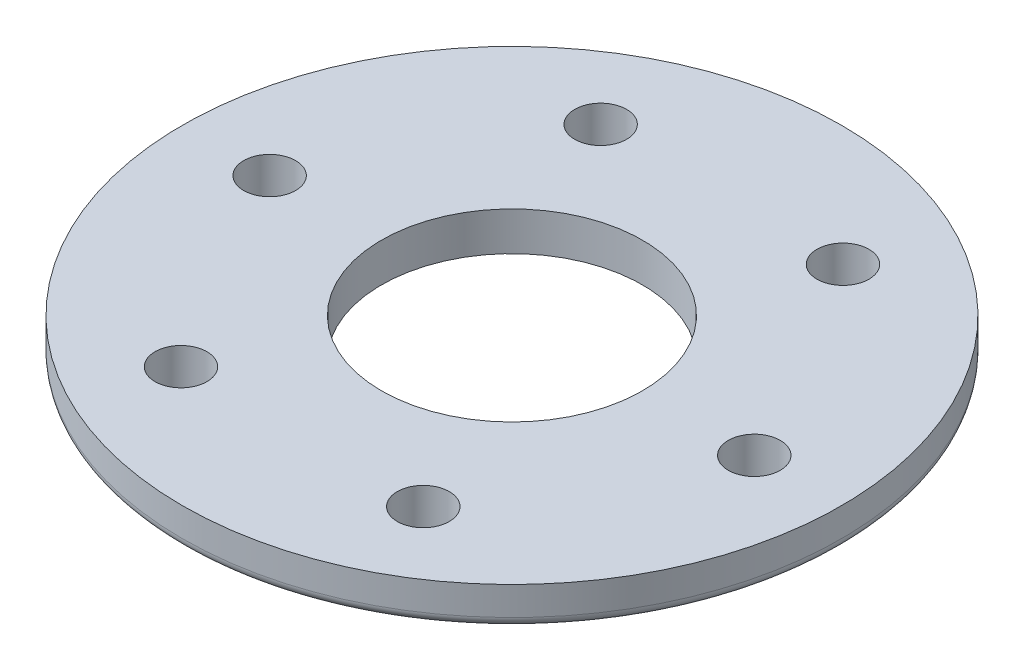
ISO-10303-21;
HEADER;
FILE_DESCRIPTION(('STEP AP214'),'2;1');
FILE_NAME('part.step','',(''),(''),'','','');
FILE_SCHEMA(('AUTOMOTIVE_DESIGN { 1 0 10303 214 1 1 1 1 }'));
ENDSEC;
DATA;
#1=APPLICATION_CONTEXT('core data for automotive mechanical design processes');
#2=APPLICATION_PROTOCOL_DEFINITION('international standard','automotive_design',2000,#1);
#3=PRODUCT_CONTEXT('',#1,'mechanical');
#4=PRODUCT('Part','Part','',(#3));
#5=PRODUCT_RELATED_PRODUCT_CATEGORY('part','',(#4));
#6=PRODUCT_DEFINITION_FORMATION('','',#4);
#7=PRODUCT_DEFINITION_CONTEXT('part definition',#1,'design');
#8=PRODUCT_DEFINITION('design','',#6,#7);
#9=PRODUCT_DEFINITION_SHAPE('','',#8);
#10=(LENGTH_UNIT() NAMED_UNIT(*) SI_UNIT(.MILLI.,.METRE.));
#11=(NAMED_UNIT(*) PLANE_ANGLE_UNIT() SI_UNIT($,.RADIAN.));
#12=(NAMED_UNIT(*) SI_UNIT($,.STERADIAN.) SOLID_ANGLE_UNIT());
#13=UNCERTAINTY_MEASURE_WITH_UNIT(LENGTH_MEASURE(1.E-05),#10,'distance_accuracy_value','');
#14=(GEOMETRIC_REPRESENTATION_CONTEXT(3) GLOBAL_UNCERTAINTY_ASSIGNED_CONTEXT((#13)) GLOBAL_UNIT_ASSIGNED_CONTEXT((#10,
#11,#12)) REPRESENTATION_CONTEXT('',''));
#15=CARTESIAN_POINT('',(0.,0.,0.));
#16=DIRECTION('',(0.,0.,1.));
#17=DIRECTION('',(1.,0.,0.));
#18=AXIS2_PLACEMENT_3D('',#15,#16,#17);
#19=CARTESIAN_POINT('',(0.,1.00000000000006,0.));
#20=DIRECTION('',(0.,1.,0.));
#21=DIRECTION('',(-0.999974299262359,0.,0.00716943615306271));
#22=AXIS2_PLACEMENT_3D('',#19,#20,#21);
#23=TOROIDAL_SURFACE('',#22,31.385000000004,1.00000000000006);
#24=CARTESIAN_POINT('',(0.,1.00000000000006,0.));
#25=DIRECTION('',(0.,1.,0.));
#26=DIRECTION('',(0.,0.,1.));
#27=AXIS2_PLACEMENT_3D('',#24,#25,#26);
#28=CIRCLE('',#27,32.385);
#29=CARTESIAN_POINT('',(0.,1.00000000000006,32.385));
#30=VERTEX_POINT('',#29);
#31=EDGE_CURVE('E43',#30,#30,#28,.T.);
#32=ORIENTED_EDGE('',*,*,#31,.F.);
#33=EDGE_LOOP('',(#32));
#34=FACE_BOUND('',#33,.T.);
#35=CARTESIAN_POINT('',(0.,0.,0.));
#36=DIRECTION('',(0.,1.,0.));
#37=DIRECTION('',(1.,0.,0.));
#38=AXIS2_PLACEMENT_3D('',#35,#36,#37);
#39=CIRCLE('',#38,31.385000000004);
#40=CARTESIAN_POINT('',(31.385000000004,0.,0.));
#41=VERTEX_POINT('',#40);
#42=CARTESIAN_POINT('',(-31.385000000004,0.,0.));
#43=VERTEX_POINT('',#42);
#44=EDGE_CURVE('E37',#41,#43,#39,.T.);
#45=ORIENTED_EDGE('',*,*,#44,.T.);
#46=CARTESIAN_POINT('',(0.,0.,0.));
#47=DIRECTION('',(0.,1.,0.));
#48=DIRECTION('',(-1.,0.,0.));
#49=AXIS2_PLACEMENT_3D('',#46,#47,#48);
#50=CIRCLE('',#49,31.385000000004);
#51=EDGE_CURVE('E40',#43,#41,#50,.T.);
#52=ORIENTED_EDGE('',*,*,#51,.T.);
#53=EDGE_LOOP('',(#45,#52));
#54=FACE_BOUND('',#53,.T.);
#55=ADVANCED_FACE('F19',(#34,#54),#23,.T.);
#56=CARTESIAN_POINT('',(0.,0.,0.));
#57=DIRECTION('',(0.,1.,0.));
#58=DIRECTION('',(0.,0.,1.));
#59=AXIS2_PLACEMENT_3D('',#56,#57,#58);
#60=PLANE('',#59);
#61=CARTESIAN_POINT('',(0.,0.,0.));
#62=DIRECTION('',(0.,1.,0.));
#63=DIRECTION('',(0.,0.,1.));
#64=AXIS2_PLACEMENT_3D('',#61,#62,#63);
#65=CIRCLE('',#64,12.827);
#66=CARTESIAN_POINT('',(0.,0.,12.827));
#67=VERTEX_POINT('',#66);
#68=EDGE_CURVE('E73',#67,#67,#65,.T.);
#69=ORIENTED_EDGE('',*,*,#68,.T.);
#70=EDGE_LOOP('',(#69));
#71=FACE_BOUND('',#70,.T.);
#72=CARTESIAN_POINT('',(-23.8125,0.,0.));
#73=DIRECTION('',(0.,1.,0.));
#74=DIRECTION('',(0.,0.,1.));
#75=AXIS2_PLACEMENT_3D('',#72,#73,#74);
#76=CIRCLE('',#75,2.5527);
#77=CARTESIAN_POINT('',(-23.8125,0.,2.5527));
#78=VERTEX_POINT('',#77);
#79=EDGE_CURVE('E108',#78,#78,#76,.T.);
#80=ORIENTED_EDGE('',*,*,#79,.T.);
#81=EDGE_LOOP('',(#80));
#82=FACE_BOUND('',#81,.T.);
#83=CARTESIAN_POINT('',(-11.90625,0.,20.6222299276167));
#84=DIRECTION('',(0.,1.,0.));
#85=DIRECTION('',(0.,0.,1.));
#86=AXIS2_PLACEMENT_3D('',#83,#84,#85);
#87=CIRCLE('',#86,2.5527);
#88=CARTESIAN_POINT('',(-11.90625,0.,23.1749299276167));
#89=VERTEX_POINT('',#88);
#90=EDGE_CURVE('E113',#89,#89,#87,.T.);
#91=ORIENTED_EDGE('',*,*,#90,.T.);
#92=EDGE_LOOP('',(#91));
#93=FACE_BOUND('',#92,.T.);
#94=CARTESIAN_POINT('',(11.90625,0.,20.6222299276167));
#95=DIRECTION('',(0.,1.,0.));
#96=DIRECTION('',(0.,0.,1.));
#97=AXIS2_PLACEMENT_3D('',#94,#95,#96);
#98=CIRCLE('',#97,2.5527);
#99=CARTESIAN_POINT('',(11.90625,0.,23.1749299276167));
#100=VERTEX_POINT('',#99);
#101=EDGE_CURVE('E117',#100,#100,#98,.T.);
#102=ORIENTED_EDGE('',*,*,#101,.T.);
#103=EDGE_LOOP('',(#102));
#104=FACE_BOUND('',#103,.T.);
#105=CARTESIAN_POINT('',(23.8125,0.,0.));
#106=DIRECTION('',(0.,1.,0.));
#107=DIRECTION('',(0.,0.,1.));
#108=AXIS2_PLACEMENT_3D('',#105,#106,#107);
#109=CIRCLE('',#108,2.5527);
#110=CARTESIAN_POINT('',(23.8125,0.,2.5527));
#111=VERTEX_POINT('',#110);
#112=EDGE_CURVE('E120',#111,#111,#109,.T.);
#113=ORIENTED_EDGE('',*,*,#112,.T.);
#114=EDGE_LOOP('',(#113));
#115=FACE_BOUND('',#114,.T.);
#116=CARTESIAN_POINT('',(11.90625,0.,-20.6222299276167));
#117=DIRECTION('',(0.,1.,0.));
#118=DIRECTION('',(0.,0.,1.));
#119=AXIS2_PLACEMENT_3D('',#116,#117,#118);
#120=CIRCLE('',#119,2.5527);
#121=CARTESIAN_POINT('',(11.90625,0.,-18.0695299276167));
#122=VERTEX_POINT('',#121);
#123=EDGE_CURVE('E96',#122,#122,#120,.T.);
#124=ORIENTED_EDGE('',*,*,#123,.T.);
#125=EDGE_LOOP('',(#124));
#126=FACE_BOUND('',#125,.T.);
#127=CARTESIAN_POINT('',(-11.90625,0.,-20.6222299276167));
#128=DIRECTION('',(0.,1.,0.));
#129=DIRECTION('',(0.,0.,1.));
#130=AXIS2_PLACEMENT_3D('',#127,#128,#129);
#131=CIRCLE('',#130,2.5527);
#132=CARTESIAN_POINT('',(-11.90625,0.,-18.0695299276167));
#133=VERTEX_POINT('',#132);
#134=EDGE_CURVE('E92',#133,#133,#131,.T.);
#135=ORIENTED_EDGE('',*,*,#134,.T.);
#136=EDGE_LOOP('',(#135));
#137=FACE_BOUND('',#136,.T.);
#138=ORIENTED_EDGE('',*,*,#44,.F.);
#139=ORIENTED_EDGE('',*,*,#51,.F.);
#140=EDGE_LOOP('',(#138,#139));
#141=FACE_BOUND('',#140,.T.);
#142=ADVANCED_FACE('F46',(#71,#82,#93,#104,#115,#126,#137,#141),#60,.F.);
#143=CARTESIAN_POINT('',(0.,0.,0.));
#144=DIRECTION('',(0.,1.,0.));
#145=DIRECTION('',(0.,0.,1.));
#146=AXIS2_PLACEMENT_3D('',#143,#144,#145);
#147=CYLINDRICAL_SURFACE('',#146,32.385);
#148=CARTESIAN_POINT('',(0.,3.81,0.));
#149=DIRECTION('',(0.,1.,0.));
#150=DIRECTION('',(0.,0.,1.));
#151=AXIS2_PLACEMENT_3D('',#148,#149,#150);
#152=CIRCLE('',#151,32.385);
#153=CARTESIAN_POINT('',(0.,3.81,32.385));
#154=VERTEX_POINT('',#153);
#155=EDGE_CURVE('E103',#154,#154,#152,.T.);
#156=ORIENTED_EDGE('',*,*,#155,.F.);
#157=EDGE_LOOP('',(#156));
#158=FACE_BOUND('',#157,.T.);
#159=ORIENTED_EDGE('',*,*,#31,.T.);
#160=EDGE_LOOP('',(#159));
#161=FACE_BOUND('',#160,.T.);
#162=ADVANCED_FACE('F59',(#158,#161),#147,.T.);
#163=CARTESIAN_POINT('',(0.,0.,0.));
#164=DIRECTION('',(0.,1.,0.));
#165=DIRECTION('',(0.,0.,1.));
#166=AXIS2_PLACEMENT_3D('',#163,#164,#165);
#167=CYLINDRICAL_SURFACE('',#166,12.827);
#168=CARTESIAN_POINT('',(0.,3.81,0.));
#169=DIRECTION('',(0.,1.,0.));
#170=DIRECTION('',(0.,0.,1.));
#171=AXIS2_PLACEMENT_3D('',#168,#169,#170);
#172=CIRCLE('',#171,12.827);
#173=CARTESIAN_POINT('',(0.,3.81,12.827));
#174=VERTEX_POINT('',#173);
#175=EDGE_CURVE('E107',#174,#174,#172,.F.);
#176=ORIENTED_EDGE('',*,*,#175,.F.);
#177=EDGE_LOOP('',(#176));
#178=FACE_BOUND('',#177,.T.);
#179=ORIENTED_EDGE('',*,*,#68,.F.);
#180=EDGE_LOOP('',(#179));
#181=FACE_BOUND('',#180,.T.);
#182=ADVANCED_FACE('F145',(#178,#181),#167,.F.);
#183=CARTESIAN_POINT('',(-11.90625,0.,-20.6222299276167));
#184=DIRECTION('',(0.,1.,0.));
#185=DIRECTION('',(0.,0.,1.));
#186=AXIS2_PLACEMENT_3D('',#183,#184,#185);
#187=CYLINDRICAL_SURFACE('',#186,2.5527);
#188=CARTESIAN_POINT('',(-11.90625,3.81,-20.6222299276167));
#189=DIRECTION('',(0.,1.,0.));
#190=DIRECTION('',(0.,0.,1.));
#191=AXIS2_PLACEMENT_3D('',#188,#189,#190);
#192=CIRCLE('',#191,2.5527);
#193=CARTESIAN_POINT('',(-11.90625,3.81,-18.0695299276167));
#194=VERTEX_POINT('',#193);
#195=EDGE_CURVE('E184',#194,#194,#192,.F.);
#196=ORIENTED_EDGE('',*,*,#195,.F.);
#197=EDGE_LOOP('',(#196));
#198=FACE_BOUND('',#197,.T.);
#199=ORIENTED_EDGE('',*,*,#134,.F.);
#200=EDGE_LOOP('',(#199));
#201=FACE_BOUND('',#200,.T.);
#202=ADVANCED_FACE('F134',(#198,#201),#187,.F.);
#203=CARTESIAN_POINT('',(11.90625,0.,-20.6222299276167));
#204=DIRECTION('',(0.,1.,0.));
#205=DIRECTION('',(0.,0.,1.));
#206=AXIS2_PLACEMENT_3D('',#203,#204,#205);
#207=CYLINDRICAL_SURFACE('',#206,2.5527);
#208=CARTESIAN_POINT('',(11.90625,3.81,-20.6222299276167));
#209=DIRECTION('',(0.,1.,0.));
#210=DIRECTION('',(0.,0.,1.));
#211=AXIS2_PLACEMENT_3D('',#208,#209,#210);
#212=CIRCLE('',#211,2.5527);
#213=CARTESIAN_POINT('',(11.90625,3.81,-18.0695299276167));
#214=VERTEX_POINT('',#213);
#215=EDGE_CURVE('E180',#214,#214,#212,.F.);
#216=ORIENTED_EDGE('',*,*,#215,.F.);
#217=EDGE_LOOP('',(#216));
#218=FACE_BOUND('',#217,.T.);
#219=ORIENTED_EDGE('',*,*,#123,.F.);
#220=EDGE_LOOP('',(#219));
#221=FACE_BOUND('',#220,.T.);
#222=ADVANCED_FACE('F131',(#218,#221),#207,.F.);
#223=CARTESIAN_POINT('',(23.8125,0.,0.));
#224=DIRECTION('',(0.,1.,0.));
#225=DIRECTION('',(0.,0.,1.));
#226=AXIS2_PLACEMENT_3D('',#223,#224,#225);
#227=CYLINDRICAL_SURFACE('',#226,2.5527);
#228=CARTESIAN_POINT('',(23.8125,3.81,0.));
#229=DIRECTION('',(0.,1.,0.));
#230=DIRECTION('',(0.,0.,1.));
#231=AXIS2_PLACEMENT_3D('',#228,#229,#230);
#232=CIRCLE('',#231,2.5527);
#233=CARTESIAN_POINT('',(23.8125,3.81,2.5527));
#234=VERTEX_POINT('',#233);
#235=EDGE_CURVE('E176',#234,#234,#232,.F.);
#236=ORIENTED_EDGE('',*,*,#235,.F.);
#237=EDGE_LOOP('',(#236));
#238=FACE_BOUND('',#237,.T.);
#239=ORIENTED_EDGE('',*,*,#112,.F.);
#240=EDGE_LOOP('',(#239));
#241=FACE_BOUND('',#240,.T.);
#242=ADVANCED_FACE('F133',(#238,#241),#227,.F.);
#243=CARTESIAN_POINT('',(11.90625,0.,20.6222299276167));
#244=DIRECTION('',(0.,1.,0.));
#245=DIRECTION('',(0.,0.,1.));
#246=AXIS2_PLACEMENT_3D('',#243,#244,#245);
#247=CYLINDRICAL_SURFACE('',#246,2.5527);
#248=CARTESIAN_POINT('',(11.90625,3.81,20.6222299276167));
#249=DIRECTION('',(0.,1.,0.));
#250=DIRECTION('',(0.,0.,1.));
#251=AXIS2_PLACEMENT_3D('',#248,#249,#250);
#252=CIRCLE('',#251,2.5527);
#253=CARTESIAN_POINT('',(11.90625,3.81,23.1749299276167));
#254=VERTEX_POINT('',#253);
#255=EDGE_CURVE('E172',#254,#254,#252,.F.);
#256=ORIENTED_EDGE('',*,*,#255,.F.);
#257=EDGE_LOOP('',(#256));
#258=FACE_BOUND('',#257,.T.);
#259=ORIENTED_EDGE('',*,*,#101,.F.);
#260=EDGE_LOOP('',(#259));
#261=FACE_BOUND('',#260,.T.);
#262=ADVANCED_FACE('F142',(#258,#261),#247,.F.);
#263=CARTESIAN_POINT('',(-11.90625,0.,20.6222299276167));
#264=DIRECTION('',(0.,1.,0.));
#265=DIRECTION('',(0.,0.,1.));
#266=AXIS2_PLACEMENT_3D('',#263,#264,#265);
#267=CYLINDRICAL_SURFACE('',#266,2.5527);
#268=CARTESIAN_POINT('',(-11.90625,3.81,20.6222299276167));
#269=DIRECTION('',(0.,1.,0.));
#270=DIRECTION('',(0.,0.,1.));
#271=AXIS2_PLACEMENT_3D('',#268,#269,#270);
#272=CIRCLE('',#271,2.5527);
#273=CARTESIAN_POINT('',(-11.90625,3.81,23.1749299276167));
#274=VERTEX_POINT('',#273);
#275=EDGE_CURVE('E30',#274,#274,#272,.F.);
#276=ORIENTED_EDGE('',*,*,#275,.F.);
#277=EDGE_LOOP('',(#276));
#278=FACE_BOUND('',#277,.T.);
#279=ORIENTED_EDGE('',*,*,#90,.F.);
#280=EDGE_LOOP('',(#279));
#281=FACE_BOUND('',#280,.T.);
#282=ADVANCED_FACE('F157',(#278,#281),#267,.F.);
#283=CARTESIAN_POINT('',(-23.8125,0.,0.));
#284=DIRECTION('',(0.,1.,0.));
#285=DIRECTION('',(0.,0.,1.));
#286=AXIS2_PLACEMENT_3D('',#283,#284,#285);
#287=CYLINDRICAL_SURFACE('',#286,2.5527);
#288=CARTESIAN_POINT('',(-23.8125,3.81,0.));
#289=DIRECTION('',(0.,1.,0.));
#290=DIRECTION('',(0.,0.,1.));
#291=AXIS2_PLACEMENT_3D('',#288,#289,#290);
#292=CIRCLE('',#291,2.5527);
#293=CARTESIAN_POINT('',(-23.8125,3.81,2.5527));
#294=VERTEX_POINT('',#293);
#295=EDGE_CURVE('E12',#294,#294,#292,.F.);
#296=ORIENTED_EDGE('',*,*,#295,.F.);
#297=EDGE_LOOP('',(#296));
#298=FACE_BOUND('',#297,.T.);
#299=ORIENTED_EDGE('',*,*,#79,.F.);
#300=EDGE_LOOP('',(#299));
#301=FACE_BOUND('',#300,.T.);
#302=ADVANCED_FACE('F151',(#298,#301),#287,.F.);
#303=CARTESIAN_POINT('',(0.,3.81,0.));
#304=DIRECTION('',(0.,1.,0.));
#305=DIRECTION('',(0.,0.,1.));
#306=AXIS2_PLACEMENT_3D('',#303,#304,#305);
#307=PLANE('',#306);
#308=ORIENTED_EDGE('',*,*,#295,.T.);
#309=EDGE_LOOP('',(#308));
#310=FACE_BOUND('',#309,.T.);
#311=ORIENTED_EDGE('',*,*,#275,.T.);
#312=EDGE_LOOP('',(#311));
#313=FACE_BOUND('',#312,.T.);
#314=ORIENTED_EDGE('',*,*,#255,.T.);
#315=EDGE_LOOP('',(#314));
#316=FACE_BOUND('',#315,.T.);
#317=ORIENTED_EDGE('',*,*,#235,.T.);
#318=EDGE_LOOP('',(#317));
#319=FACE_BOUND('',#318,.T.);
#320=ORIENTED_EDGE('',*,*,#215,.T.);
#321=EDGE_LOOP('',(#320));
#322=FACE_BOUND('',#321,.T.);
#323=ORIENTED_EDGE('',*,*,#195,.T.);
#324=EDGE_LOOP('',(#323));
#325=FACE_BOUND('',#324,.T.);
#326=ORIENTED_EDGE('',*,*,#175,.T.);
#327=EDGE_LOOP('',(#326));
#328=FACE_BOUND('',#327,.T.);
#329=ORIENTED_EDGE('',*,*,#155,.T.);
#330=EDGE_LOOP('',(#329));
#331=FACE_BOUND('',#330,.T.);
#332=ADVANCED_FACE('F149',(#310,#313,#316,#319,#322,#325,#328,#331),#307,.T.);
#333=CLOSED_SHELL('',(#55,#142,#162,#182,#202,#222,#242,#262,#282,#302,#332));
#334=MANIFOLD_SOLID_BREP('B1',#333);
#335=ADVANCED_BREP_SHAPE_REPRESENTATION('',(#18,#334),#14);
#336=SHAPE_DEFINITION_REPRESENTATION(#9,#335);
ENDSEC;
END-ISO-10303-21;
